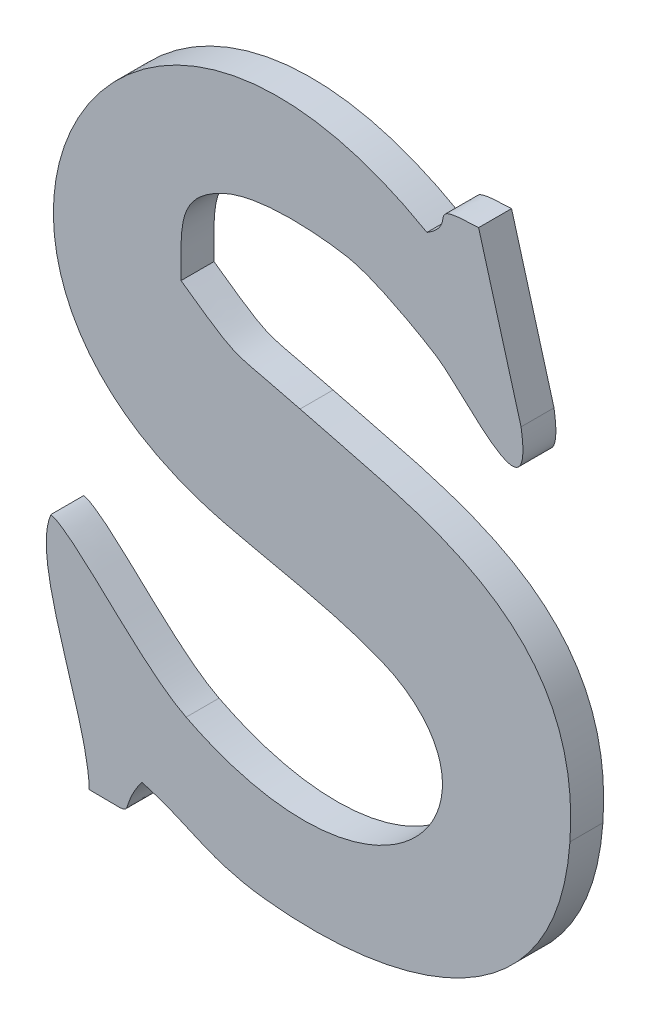
ISO-10303-21;
HEADER;
FILE_DESCRIPTION(('STEP AP214'),'2;1');
FILE_NAME('part.step','',(''),(''),'','','');
FILE_SCHEMA(('AUTOMOTIVE_DESIGN { 1 0 10303 214 1 1 1 1 }'));
ENDSEC;
DATA;
#1=APPLICATION_CONTEXT('core data for automotive mechanical design processes');
#2=APPLICATION_PROTOCOL_DEFINITION('international standard','automotive_design',2000,#1);
#3=PRODUCT_CONTEXT('',#1,'mechanical');
#4=PRODUCT('Part','Part','',(#3));
#5=PRODUCT_RELATED_PRODUCT_CATEGORY('part','',(#4));
#6=PRODUCT_DEFINITION_FORMATION('','',#4);
#7=PRODUCT_DEFINITION_CONTEXT('part definition',#1,'design');
#8=PRODUCT_DEFINITION('design','',#6,#7);
#9=PRODUCT_DEFINITION_SHAPE('','',#8);
#10=(LENGTH_UNIT() NAMED_UNIT(*) SI_UNIT(.MILLI.,.METRE.));
#11=(NAMED_UNIT(*) PLANE_ANGLE_UNIT() SI_UNIT($,.RADIAN.));
#12=(NAMED_UNIT(*) SI_UNIT($,.STERADIAN.) SOLID_ANGLE_UNIT());
#13=UNCERTAINTY_MEASURE_WITH_UNIT(LENGTH_MEASURE(1.E-05),#10,'distance_accuracy_value','');
#14=(GEOMETRIC_REPRESENTATION_CONTEXT(3) GLOBAL_UNCERTAINTY_ASSIGNED_CONTEXT((#13)) GLOBAL_UNIT_ASSIGNED_CONTEXT((#10,
#11,#12)) REPRESENTATION_CONTEXT('',''));
#15=CARTESIAN_POINT('',(0.,0.,0.));
#16=DIRECTION('',(0.,0.,1.));
#17=DIRECTION('',(1.,0.,0.));
#18=AXIS2_PLACEMENT_3D('',#15,#16,#17);
#19=CARTESIAN_POINT('',(50.3180959999998,11.206695,0.001));
#20=CARTESIAN_POINT('',(50.3180959999998,11.206695,0.));
#21=CARTESIAN_POINT('',(50.3213579999998,11.204469,0.001));
#22=CARTESIAN_POINT('',(50.3213579999998,11.204469,0.));
#23=CARTESIAN_POINT('',(50.3172699999998,11.199681,0.001));
#24=CARTESIAN_POINT('',(50.3172699999998,11.199681,0.));
#25=CARTESIAN_POINT('',(50.3114739999998,11.202621,0.001));
#26=CARTESIAN_POINT('',(50.3114739999998,11.202621,0.));
#27=B_SPLINE_SURFACE_WITH_KNOTS('',3,1,((#19,#20),(#21,#22),(#23,#24),(#25,#26)),.UNSPECIFIED.,
.F.,.F.,.F.,(4,4),(2,2),(0.823529411764706,0.882352941176471),(0.,1.),.UNSPECIFIED.);
#28=CARTESIAN_POINT('',(50.3180959999998,11.206695,0.));
#29=CARTESIAN_POINT('',(50.3213579999998,11.204469,0.));
#30=CARTESIAN_POINT('',(50.3172699999998,11.199681,0.));
#31=CARTESIAN_POINT('',(50.3114739999998,11.202621,0.));
#32=B_SPLINE_CURVE_WITH_KNOTS('',3,(#28,#29,#30,#31),.UNSPECIFIED.,.F.,.F.,(4,4),
(0.823529411764706,0.882352941176471),.UNSPECIFIED.);
#33=CARTESIAN_POINT('',(50.3180959999998,11.206695,0.));
#34=VERTEX_POINT('',#33);
#35=CARTESIAN_POINT('',(50.3114739999998,11.202621,0.));
#36=VERTEX_POINT('',#35);
#37=EDGE_CURVE('E11',#34,#36,#32,.T.);
#38=DIRECTION('',(0.,0.,-1.));
#39=VECTOR('',#38,1.);
#40=CARTESIAN_POINT('',(50.3114739999998,11.202621,0.001));
#41=LINE('',#40,#39);
#42=CARTESIAN_POINT('',(50.3114739999998,11.202621,0.001));
#43=VERTEX_POINT('',#42);
#44=EDGE_CURVE('E28',#43,#36,#41,.T.);
#45=CARTESIAN_POINT('',(50.3180959999998,11.206695,0.001));
#46=CARTESIAN_POINT('',(50.3213579999998,11.204469,0.001));
#47=CARTESIAN_POINT('',(50.3172699999998,11.199681,0.001));
#48=CARTESIAN_POINT('',(50.3114739999998,11.202621,0.001));
#49=B_SPLINE_CURVE_WITH_KNOTS('',3,(#45,#46,#47,#48),.UNSPECIFIED.,.F.,.F.,(4,4),
(0.823529411764706,0.882352941176471),.UNSPECIFIED.);
#50=CARTESIAN_POINT('',(50.3180959999998,11.206695,0.001));
#51=VERTEX_POINT('',#50);
#52=EDGE_CURVE('E389',#51,#43,#49,.T.);
#53=DIRECTION('',(0.,0.,-1.));
#54=VECTOR('',#53,1.);
#55=CARTESIAN_POINT('',(50.3180959999998,11.206695,0.001));
#56=LINE('',#55,#54);
#57=EDGE_CURVE('E40',#51,#34,#56,.T.);
#58=ORIENTED_EDGE('',*,*,#37,.T.);
#59=ORIENTED_EDGE('',*,*,#44,.F.);
#60=ORIENTED_EDGE('',*,*,#52,.F.);
#61=ORIENTED_EDGE('',*,*,#57,.T.);
#62=EDGE_LOOP('',(#58,#59,#60,#61));
#63=FACE_BOUND('',#62,.T.);
#64=ADVANCED_FACE('F17',(#63),#27,.F.);
#65=CARTESIAN_POINT('',(50.3114739999998,11.202621,0.001));
#66=CARTESIAN_POINT('',(50.3114739999998,11.202621,0.));
#67=CARTESIAN_POINT('',(50.3100599999998,11.203335,0.001));
#68=CARTESIAN_POINT('',(50.3100599999998,11.203335,0.));
#69=CARTESIAN_POINT('',(50.3081559999998,11.205673,0.001));
#70=CARTESIAN_POINT('',(50.3081559999998,11.205673,0.));
#71=CARTESIAN_POINT('',(50.3073719999998,11.205897,0.001));
#72=CARTESIAN_POINT('',(50.3073719999998,11.205897,0.));
#73=B_SPLINE_SURFACE_WITH_KNOTS('',3,1,((#65,#66),(#67,#68),(#69,#70),(#71,#72)),.UNSPECIFIED.,
.F.,.F.,.F.,(4,4),(2,2),(0.882352941176471,1.),(0.,1.),.UNSPECIFIED.);
#74=CARTESIAN_POINT('',(50.3114739999998,11.202621,0.));
#75=CARTESIAN_POINT('',(50.3100599999998,11.203335,0.));
#76=CARTESIAN_POINT('',(50.3081559999998,11.205673,0.));
#77=CARTESIAN_POINT('',(50.3073719999998,11.205897,0.));
#78=B_SPLINE_CURVE_WITH_KNOTS('',3,(#74,#75,#76,#77),.UNSPECIFIED.,.F.,.F.,(4,4),
(0.882352941176471,1.),.UNSPECIFIED.);
#79=CARTESIAN_POINT('',(50.3073719999998,11.205897,0.));
#80=VERTEX_POINT('',#79);
#81=EDGE_CURVE('E381',#36,#80,#78,.T.);
#82=DIRECTION('',(0.,0.,-1.));
#83=VECTOR('',#82,1.);
#84=CARTESIAN_POINT('',(50.3073719999998,11.205897,0.001));
#85=LINE('',#84,#83);
#86=CARTESIAN_POINT('',(50.3073719999998,11.205897,0.001));
#87=VERTEX_POINT('',#86);
#88=EDGE_CURVE('E376',#87,#80,#85,.T.);
#89=CARTESIAN_POINT('',(50.3114739999998,11.202621,0.001));
#90=CARTESIAN_POINT('',(50.3100599999998,11.203335,0.001));
#91=CARTESIAN_POINT('',(50.3081559999998,11.205673,0.001));
#92=CARTESIAN_POINT('',(50.3073719999998,11.205897,0.001));
#93=B_SPLINE_CURVE_WITH_KNOTS('',3,(#89,#90,#91,#92),.UNSPECIFIED.,.F.,.F.,(4,4),
(0.882352941176471,1.),.UNSPECIFIED.);
#94=EDGE_CURVE('E369',#43,#87,#93,.T.);
#95=ORIENTED_EDGE('',*,*,#81,.T.);
#96=ORIENTED_EDGE('',*,*,#88,.F.);
#97=ORIENTED_EDGE('',*,*,#94,.F.);
#98=ORIENTED_EDGE('',*,*,#44,.T.);
#99=EDGE_LOOP('',(#95,#96,#97,#98));
#100=FACE_BOUND('',#99,.T.);
#101=ADVANCED_FACE('F397',(#100),#73,.F.);
#102=CARTESIAN_POINT('',(50.3073719999998,11.205897,0.001));
#103=CARTESIAN_POINT('',(50.3073719999998,11.205897,0.));
#104=CARTESIAN_POINT('',(50.3067279999998,11.204385,0.001));
#105=CARTESIAN_POINT('',(50.3067279999998,11.204385,0.));
#106=CARTESIAN_POINT('',(50.3085059999998,11.201095,0.001));
#107=CARTESIAN_POINT('',(50.3085059999998,11.201095,0.));
#108=CARTESIAN_POINT('',(50.3085339999998,11.199247,0.001));
#109=CARTESIAN_POINT('',(50.3085339999998,11.199247,0.));
#110=B_SPLINE_SURFACE_WITH_KNOTS('',3,1,((#102,#103),(#104,#105),(#106,#107),(#108,#109)),
.UNSPECIFIED.,.F.,.F.,.F.,(4,4),(2,2),(0.,0.0588235294117647),(0.,1.),.UNSPECIFIED.);
#111=CARTESIAN_POINT('',(50.3073719999998,11.205897,0.));
#112=CARTESIAN_POINT('',(50.3067279999998,11.204385,0.));
#113=CARTESIAN_POINT('',(50.3085059999998,11.201095,0.));
#114=CARTESIAN_POINT('',(50.3085339999998,11.199247,0.));
#115=B_SPLINE_CURVE_WITH_KNOTS('',3,(#111,#112,#113,#114),.UNSPECIFIED.,.F.,.F.,(4,4),(0.,
0.0588235294117647),.UNSPECIFIED.);
#116=CARTESIAN_POINT('',(50.3085339999998,11.199247,0.));
#117=VERTEX_POINT('',#116);
#118=EDGE_CURVE('E364',#80,#117,#115,.T.);
#119=DIRECTION('',(0.,0.,-1.));
#120=VECTOR('',#119,1.);
#121=CARTESIAN_POINT('',(50.3085339999998,11.199247,0.001));
#122=LINE('',#121,#120);
#123=CARTESIAN_POINT('',(50.3085339999998,11.199247,0.001));
#124=VERTEX_POINT('',#123);
#125=EDGE_CURVE('E359',#124,#117,#122,.T.);
#126=CARTESIAN_POINT('',(50.3073719999998,11.205897,0.001));
#127=CARTESIAN_POINT('',(50.3067279999998,11.204385,0.001));
#128=CARTESIAN_POINT('',(50.3085059999998,11.201095,0.001));
#129=CARTESIAN_POINT('',(50.3085339999998,11.199247,0.001));
#130=B_SPLINE_CURVE_WITH_KNOTS('',3,(#126,#127,#128,#129),.UNSPECIFIED.,.F.,.F.,(4,4),(0.,
0.0588235294117647),.UNSPECIFIED.);
#131=EDGE_CURVE('E352',#87,#124,#130,.T.);
#132=ORIENTED_EDGE('',*,*,#118,.T.);
#133=ORIENTED_EDGE('',*,*,#125,.F.);
#134=ORIENTED_EDGE('',*,*,#131,.F.);
#135=ORIENTED_EDGE('',*,*,#88,.T.);
#136=EDGE_LOOP('',(#132,#133,#134,#135));
#137=FACE_BOUND('',#136,.T.);
#138=ADVANCED_FACE('F402',(#137),#110,.F.);
#139=CARTESIAN_POINT('',(50.3085339999998,11.199247,0.000999999999999998));
#140=CARTESIAN_POINT('',(50.3085339999998,11.199247,0.));
#141=CARTESIAN_POINT('',(50.3102279999998,11.199247,0.000999999999999998));
#142=CARTESIAN_POINT('',(50.3102279999998,11.199247,0.));
#143=CARTESIAN_POINT('',(50.3092759999998,11.199065,0.000999999999999998));
#144=CARTESIAN_POINT('',(50.3092759999998,11.199065,0.));
#145=CARTESIAN_POINT('',(50.3101299999998,11.200241,0.000999999999999998));
#146=CARTESIAN_POINT('',(50.3101299999998,11.200241,0.));
#147=B_SPLINE_SURFACE_WITH_KNOTS('',3,1,((#139,#140),(#141,#142),(#143,#144),(#145,#146)),
.UNSPECIFIED.,.F.,.F.,.F.,(4,4),(2,2),(0.0588235294117647,0.117647058823529),(0.,1.),.UNSPECIFIED.);
#148=CARTESIAN_POINT('',(50.3085339999998,11.199247,0.));
#149=CARTESIAN_POINT('',(50.3102279999998,11.199247,0.));
#150=CARTESIAN_POINT('',(50.3092759999998,11.199065,0.));
#151=CARTESIAN_POINT('',(50.3101299999998,11.200241,0.));
#152=B_SPLINE_CURVE_WITH_KNOTS('',3,(#148,#149,#150,#151),.UNSPECIFIED.,.F.,.F.,(4,4),
(0.0588235294117647,0.117647058823529),.UNSPECIFIED.);
#153=CARTESIAN_POINT('',(50.3101299999998,11.200241,0.));
#154=VERTEX_POINT('',#153);
#155=EDGE_CURVE('E347',#117,#154,#152,.T.);
#156=DIRECTION('',(0.,0.,-1.));
#157=VECTOR('',#156,1.);
#158=CARTESIAN_POINT('',(50.3101299999998,11.200241,0.000999999999999998));
#159=LINE('',#158,#157);
#160=CARTESIAN_POINT('',(50.3101299999998,11.200241,0.000999999999999998));
#161=VERTEX_POINT('',#160);
#162=EDGE_CURVE('E342',#161,#154,#159,.T.);
#163=CARTESIAN_POINT('',(50.3085339999998,11.199247,0.001));
#164=CARTESIAN_POINT('',(50.3102279999998,11.199247,0.000999999999999998));
#165=CARTESIAN_POINT('',(50.3092759999998,11.199065,0.000999999999999998));
#166=CARTESIAN_POINT('',(50.3101299999998,11.200241,0.000999999999999998));
#167=B_SPLINE_CURVE_WITH_KNOTS('',3,(#163,#164,#165,#166),.UNSPECIFIED.,.F.,.F.,(4,4),
(0.0588235294117647,0.117647058823529),.UNSPECIFIED.);
#168=EDGE_CURVE('E335',#124,#161,#167,.T.);
#169=ORIENTED_EDGE('',*,*,#155,.T.);
#170=ORIENTED_EDGE('',*,*,#162,.F.);
#171=ORIENTED_EDGE('',*,*,#168,.F.);
#172=ORIENTED_EDGE('',*,*,#125,.T.);
#173=EDGE_LOOP('',(#169,#170,#171,#172));
#174=FACE_BOUND('',#173,.T.);
#175=ADVANCED_FACE('F408',(#174),#147,.F.);
#176=CARTESIAN_POINT('',(50.3101299999998,11.200241,0.001));
#177=CARTESIAN_POINT('',(50.3101299999998,11.200241,0.));
#178=CARTESIAN_POINT('',(50.3115299999998,11.199877,0.001));
#179=CARTESIAN_POINT('',(50.3115299999998,11.199877,0.));
#180=CARTESIAN_POINT('',(50.3121039999998,11.199233,0.001));
#181=CARTESIAN_POINT('',(50.3121039999998,11.199233,0.));
#182=CARTESIAN_POINT('',(50.3138959999998,11.199037,0.001));
#183=CARTESIAN_POINT('',(50.3138959999998,11.199037,0.));
#184=B_SPLINE_SURFACE_WITH_KNOTS('',3,1,((#176,#177),(#178,#179),(#180,#181),(#182,#183)),
.UNSPECIFIED.,.F.,.F.,.F.,(4,4),(2,2),(0.117647058823529,0.176470588235294),(0.,1.),.UNSPECIFIED.);
#185=CARTESIAN_POINT('',(50.3101299999998,11.200241,0.));
#186=CARTESIAN_POINT('',(50.3115299999998,11.199877,0.));
#187=CARTESIAN_POINT('',(50.3121039999998,11.199233,0.));
#188=CARTESIAN_POINT('',(50.3138959999998,11.199037,0.));
#189=B_SPLINE_CURVE_WITH_KNOTS('',3,(#185,#186,#187,#188),.UNSPECIFIED.,.F.,.F.,(4,4),
(0.117647058823529,0.176470588235294),.UNSPECIFIED.);
#190=CARTESIAN_POINT('',(50.3138959999998,11.199037,0.));
#191=VERTEX_POINT('',#190);
#192=EDGE_CURVE('E330',#154,#191,#189,.T.);
#193=DIRECTION('',(0.,0.,-1.));
#194=VECTOR('',#193,1.);
#195=CARTESIAN_POINT('',(50.3138959999998,11.199037,0.001));
#196=LINE('',#195,#194);
#197=CARTESIAN_POINT('',(50.3138959999998,11.199037,0.001));
#198=VERTEX_POINT('',#197);
#199=EDGE_CURVE('E325',#198,#191,#196,.T.);
#200=CARTESIAN_POINT('',(50.3101299999998,11.200241,0.000999999999999998));
#201=CARTESIAN_POINT('',(50.3115299999998,11.199877,0.001));
#202=CARTESIAN_POINT('',(50.3121039999998,11.199233,0.001));
#203=CARTESIAN_POINT('',(50.3138959999998,11.199037,0.001));
#204=B_SPLINE_CURVE_WITH_KNOTS('',3,(#200,#201,#202,#203),.UNSPECIFIED.,.F.,.F.,(4,4),
(0.117647058823529,0.176470588235294),.UNSPECIFIED.);
#205=EDGE_CURVE('E318',#161,#198,#204,.T.);
#206=ORIENTED_EDGE('',*,*,#192,.T.);
#207=ORIENTED_EDGE('',*,*,#199,.F.);
#208=ORIENTED_EDGE('',*,*,#205,.F.);
#209=ORIENTED_EDGE('',*,*,#162,.T.);
#210=EDGE_LOOP('',(#206,#207,#208,#209));
#211=FACE_BOUND('',#210,.T.);
#212=ADVANCED_FACE('F412',(#211),#184,.F.);
#213=CARTESIAN_POINT('',(50.3138959999998,11.199037,0.001));
#214=CARTESIAN_POINT('',(50.3138959999998,11.199037,0.));
#215=CARTESIAN_POINT('',(50.3180539999998,11.198575,0.001));
#216=CARTESIAN_POINT('',(50.3180539999998,11.198575,0.));
#217=CARTESIAN_POINT('',(50.3227579999998,11.200017,0.001));
#218=CARTESIAN_POINT('',(50.3227579999998,11.200017,0.));
#219=CARTESIAN_POINT('',(50.3231219999998,11.205169,0.001));
#220=CARTESIAN_POINT('',(50.3231219999998,11.205169,0.));
#221=B_SPLINE_SURFACE_WITH_KNOTS('',3,1,((#213,#214),(#215,#216),(#217,#218),(#219,#220)),
.UNSPECIFIED.,.F.,.F.,.F.,(4,4),(2,2),(0.176470588235294,0.235294117647059),(0.,1.),.UNSPECIFIED.);
#222=CARTESIAN_POINT('',(50.3138959999998,11.199037,0.));
#223=CARTESIAN_POINT('',(50.3180539999998,11.198575,0.));
#224=CARTESIAN_POINT('',(50.3227579999998,11.200017,0.));
#225=CARTESIAN_POINT('',(50.3231219999998,11.205169,0.));
#226=B_SPLINE_CURVE_WITH_KNOTS('',3,(#222,#223,#224,#225),.UNSPECIFIED.,.F.,.F.,(4,4),
(0.176470588235294,0.235294117647059),.UNSPECIFIED.);
#227=CARTESIAN_POINT('',(50.3231219999998,11.205169,0.));
#228=VERTEX_POINT('',#227);
#229=EDGE_CURVE('E313',#191,#228,#226,.T.);
#230=DIRECTION('',(0.,0.,-1.));
#231=VECTOR('',#230,1.);
#232=CARTESIAN_POINT('',(50.3231219999998,11.205169,0.001));
#233=LINE('',#232,#231);
#234=CARTESIAN_POINT('',(50.3231219999998,11.205169,0.001));
#235=VERTEX_POINT('',#234);
#236=EDGE_CURVE('E308',#235,#228,#233,.T.);
#237=CARTESIAN_POINT('',(50.3138959999998,11.199037,0.001));
#238=CARTESIAN_POINT('',(50.3180539999998,11.198575,0.001));
#239=CARTESIAN_POINT('',(50.3227579999998,11.200017,0.001));
#240=CARTESIAN_POINT('',(50.3231219999998,11.205169,0.001));
#241=B_SPLINE_CURVE_WITH_KNOTS('',3,(#237,#238,#239,#240),.UNSPECIFIED.,.F.,.F.,(4,4),
(0.176470588235294,0.235294117647059),.UNSPECIFIED.);
#242=EDGE_CURVE('E301',#198,#235,#241,.T.);
#243=ORIENTED_EDGE('',*,*,#229,.T.);
#244=ORIENTED_EDGE('',*,*,#236,.F.);
#245=ORIENTED_EDGE('',*,*,#242,.F.);
#246=ORIENTED_EDGE('',*,*,#199,.T.);
#247=EDGE_LOOP('',(#243,#244,#245,#246));
#248=FACE_BOUND('',#247,.T.);
#249=ADVANCED_FACE('F417',(#248),#221,.F.);
#250=CARTESIAN_POINT('',(50.3231219999998,11.205169,0.001));
#251=CARTESIAN_POINT('',(50.3231219999998,11.205169,0.));
#252=CARTESIAN_POINT('',(50.3235419999998,11.210937,0.001));
#253=CARTESIAN_POINT('',(50.3235419999998,11.210937,0.));
#254=CARTESIAN_POINT('',(50.3182779999998,11.211539,0.001));
#255=CARTESIAN_POINT('',(50.3182779999998,11.211539,0.));
#256=CARTESIAN_POINT('',(50.3149319999998,11.212449,0.001));
#257=CARTESIAN_POINT('',(50.3149319999998,11.212449,0.));
#258=B_SPLINE_SURFACE_WITH_KNOTS('',3,1,((#250,#251),(#252,#253),(#254,#255),(#256,#257)),
.UNSPECIFIED.,.F.,.F.,.F.,(4,4),(2,2),(0.235294117647059,0.294117647058823),(0.,1.),.UNSPECIFIED.);
#259=CARTESIAN_POINT('',(50.3231219999998,11.205169,0.));
#260=CARTESIAN_POINT('',(50.3235419999998,11.210937,0.));
#261=CARTESIAN_POINT('',(50.3182779999998,11.211539,0.));
#262=CARTESIAN_POINT('',(50.3149319999998,11.212449,0.));
#263=B_SPLINE_CURVE_WITH_KNOTS('',3,(#259,#260,#261,#262),.UNSPECIFIED.,.F.,.F.,(4,4),
(0.235294117647059,0.294117647058823),.UNSPECIFIED.);
#264=CARTESIAN_POINT('',(50.3149319999998,11.212449,0.));
#265=VERTEX_POINT('',#264);
#266=EDGE_CURVE('E296',#228,#265,#263,.T.);
#267=DIRECTION('',(0.,0.,-1.));
#268=VECTOR('',#267,1.);
#269=CARTESIAN_POINT('',(50.3149319999998,11.212449,0.001));
#270=LINE('',#269,#268);
#271=CARTESIAN_POINT('',(50.3149319999998,11.212449,0.001));
#272=VERTEX_POINT('',#271);
#273=EDGE_CURVE('E291',#272,#265,#270,.T.);
#274=CARTESIAN_POINT('',(50.3231219999998,11.205169,0.001));
#275=CARTESIAN_POINT('',(50.3235419999998,11.210937,0.001));
#276=CARTESIAN_POINT('',(50.3182779999998,11.211539,0.001));
#277=CARTESIAN_POINT('',(50.3149319999998,11.212449,0.001));
#278=B_SPLINE_CURVE_WITH_KNOTS('',3,(#274,#275,#276,#277),.UNSPECIFIED.,.F.,.F.,(4,4),
(0.235294117647059,0.294117647058823),.UNSPECIFIED.);
#279=EDGE_CURVE('E284',#235,#272,#278,.T.);
#280=ORIENTED_EDGE('',*,*,#266,.T.);
#281=ORIENTED_EDGE('',*,*,#273,.F.);
#282=ORIENTED_EDGE('',*,*,#279,.F.);
#283=ORIENTED_EDGE('',*,*,#236,.T.);
#284=EDGE_LOOP('',(#280,#281,#282,#283));
#285=FACE_BOUND('',#284,.T.);
#286=ADVANCED_FACE('F423',(#285),#258,.F.);
#287=CARTESIAN_POINT('',(50.3149319999998,11.212449,0.001));
#288=CARTESIAN_POINT('',(50.3149319999998,11.212449,0.));
#289=CARTESIAN_POINT('',(50.3127199999998,11.213037,0.001));
#290=CARTESIAN_POINT('',(50.3127199999998,11.213037,0.));
#291=CARTESIAN_POINT('',(50.3132379999998,11.212659,0.001));
#292=CARTESIAN_POINT('',(50.3132379999998,11.212659,0.));
#293=CARTESIAN_POINT('',(50.3113199999998,11.214017,0.001));
#294=CARTESIAN_POINT('',(50.3113199999998,11.214017,0.));
#295=B_SPLINE_SURFACE_WITH_KNOTS('',3,1,((#287,#288),(#289,#290),(#291,#292),(#293,#294)),
.UNSPECIFIED.,.F.,.F.,.F.,(4,4),(2,2),(0.294117647058823,0.352941176470588),(0.,1.),.UNSPECIFIED.);
#296=CARTESIAN_POINT('',(50.3149319999998,11.212449,0.));
#297=CARTESIAN_POINT('',(50.3127199999998,11.213037,0.));
#298=CARTESIAN_POINT('',(50.3132379999998,11.212659,0.));
#299=CARTESIAN_POINT('',(50.3113199999998,11.214017,0.));
#300=B_SPLINE_CURVE_WITH_KNOTS('',3,(#296,#297,#298,#299),.UNSPECIFIED.,.F.,.F.,(4,4),
(0.294117647058823,0.352941176470588),.UNSPECIFIED.);
#301=CARTESIAN_POINT('',(50.3113199999998,11.214017,0.));
#302=VERTEX_POINT('',#301);
#303=EDGE_CURVE('E279',#265,#302,#300,.T.);
#304=DIRECTION('',(0.,0.,-1.));
#305=VECTOR('',#304,1.);
#306=CARTESIAN_POINT('',(50.3113199999998,11.214017,0.001));
#307=LINE('',#306,#305);
#308=CARTESIAN_POINT('',(50.3113199999998,11.214017,0.001));
#309=VERTEX_POINT('',#308);
#310=EDGE_CURVE('E274',#309,#302,#307,.T.);
#311=CARTESIAN_POINT('',(50.3149319999998,11.212449,0.001));
#312=CARTESIAN_POINT('',(50.3127199999998,11.213037,0.001));
#313=CARTESIAN_POINT('',(50.3132379999998,11.212659,0.001));
#314=CARTESIAN_POINT('',(50.3113199999998,11.214017,0.001));
#315=B_SPLINE_CURVE_WITH_KNOTS('',3,(#311,#312,#313,#314),.UNSPECIFIED.,.F.,.F.,(4,4),
(0.294117647058823,0.352941176470588),.UNSPECIFIED.);
#316=EDGE_CURVE('E267',#272,#309,#315,.T.);
#317=ORIENTED_EDGE('',*,*,#303,.T.);
#318=ORIENTED_EDGE('',*,*,#310,.F.);
#319=ORIENTED_EDGE('',*,*,#316,.F.);
#320=ORIENTED_EDGE('',*,*,#273,.T.);
#321=EDGE_LOOP('',(#317,#318,#319,#320));
#322=FACE_BOUND('',#321,.T.);
#323=ADVANCED_FACE('F427',(#322),#295,.F.);
#324=CARTESIAN_POINT('',(50.3113199999998,11.214017,0.001));
#325=CARTESIAN_POINT('',(50.3113199999998,11.214017,0.));
#326=CARTESIAN_POINT('',(50.3113199999998,11.215431,0.001));
#327=CARTESIAN_POINT('',(50.3113199999998,11.215431,0.));
#328=CARTESIAN_POINT('',(50.3111799999998,11.216243,0.001));
#329=CARTESIAN_POINT('',(50.3111799999998,11.216243,0.));
#330=CARTESIAN_POINT('',(50.3125239999998,11.216915,0.001));
#331=CARTESIAN_POINT('',(50.3125239999998,11.216915,0.));
#332=B_SPLINE_SURFACE_WITH_KNOTS('',3,1,((#324,#325),(#326,#327),(#328,#329),(#330,#331)),
.UNSPECIFIED.,.F.,.F.,.F.,(4,4),(2,2),(0.352941176470588,0.411764705882353),(0.,1.),.UNSPECIFIED.);
#333=CARTESIAN_POINT('',(50.3113199999998,11.214017,0.));
#334=CARTESIAN_POINT('',(50.3113199999998,11.215431,0.));
#335=CARTESIAN_POINT('',(50.3111799999998,11.216243,0.));
#336=CARTESIAN_POINT('',(50.3125239999998,11.216915,0.));
#337=B_SPLINE_CURVE_WITH_KNOTS('',3,(#333,#334,#335,#336),.UNSPECIFIED.,.F.,.F.,(4,4),
(0.352941176470588,0.411764705882353),.UNSPECIFIED.);
#338=CARTESIAN_POINT('',(50.3125239999998,11.216915,0.));
#339=VERTEX_POINT('',#338);
#340=EDGE_CURVE('E262',#302,#339,#337,.T.);
#341=DIRECTION('',(0.,0.,-1.));
#342=VECTOR('',#341,1.);
#343=CARTESIAN_POINT('',(50.3125239999998,11.216915,0.001));
#344=LINE('',#343,#342);
#345=CARTESIAN_POINT('',(50.3125239999998,11.216915,0.001));
#346=VERTEX_POINT('',#345);
#347=EDGE_CURVE('E257',#346,#339,#344,.T.);
#348=CARTESIAN_POINT('',(50.3113199999998,11.214017,0.001));
#349=CARTESIAN_POINT('',(50.3113199999998,11.215431,0.001));
#350=CARTESIAN_POINT('',(50.3111799999998,11.216243,0.001));
#351=CARTESIAN_POINT('',(50.3125239999998,11.216915,0.001));
#352=B_SPLINE_CURVE_WITH_KNOTS('',3,(#348,#349,#350,#351),.UNSPECIFIED.,.F.,.F.,(4,4),
(0.352941176470588,0.411764705882353),.UNSPECIFIED.);
#353=EDGE_CURVE('E250',#309,#346,#352,.T.);
#354=ORIENTED_EDGE('',*,*,#340,.T.);
#355=ORIENTED_EDGE('',*,*,#347,.F.);
#356=ORIENTED_EDGE('',*,*,#353,.F.);
#357=ORIENTED_EDGE('',*,*,#310,.T.);
#358=EDGE_LOOP('',(#354,#355,#356,#357));
#359=FACE_BOUND('',#358,.T.);
#360=ADVANCED_FACE('F432',(#359),#332,.F.);
#361=CARTESIAN_POINT('',(50.3125239999998,11.216915,0.000999999999999998));
#362=CARTESIAN_POINT('',(50.3125239999998,11.216915,0.));
#363=CARTESIAN_POINT('',(50.3135459999998,11.217433,0.000999999999999998));
#364=CARTESIAN_POINT('',(50.3135459999998,11.217433,0.));
#365=CARTESIAN_POINT('',(50.3152259999998,11.217363,0.000999999999999998));
#366=CARTESIAN_POINT('',(50.3152259999998,11.217363,0.));
#367=CARTESIAN_POINT('',(50.3163599999998,11.217167,0.000999999999999998));
#368=CARTESIAN_POINT('',(50.3163599999998,11.217167,0.));
#369=B_SPLINE_SURFACE_WITH_KNOTS('',3,1,((#361,#362),(#363,#364),(#365,#366),(#367,#368)),
.UNSPECIFIED.,.F.,.F.,.F.,(4,4),(2,2),(0.411764705882353,0.470588235294118),(0.,1.),.UNSPECIFIED.);
#370=CARTESIAN_POINT('',(50.3125239999998,11.216915,0.));
#371=CARTESIAN_POINT('',(50.3135459999998,11.217433,0.));
#372=CARTESIAN_POINT('',(50.3152259999998,11.217363,0.));
#373=CARTESIAN_POINT('',(50.3163599999998,11.217167,0.));
#374=B_SPLINE_CURVE_WITH_KNOTS('',3,(#370,#371,#372,#373),.UNSPECIFIED.,.F.,.F.,(4,4),
(0.411764705882353,0.470588235294118),.UNSPECIFIED.);
#375=CARTESIAN_POINT('',(50.3163599999998,11.217167,0.));
#376=VERTEX_POINT('',#375);
#377=EDGE_CURVE('E245',#339,#376,#374,.T.);
#378=DIRECTION('',(0.,0.,-1.));
#379=VECTOR('',#378,1.);
#380=CARTESIAN_POINT('',(50.3163599999998,11.217167,0.000999999999999998));
#381=LINE('',#380,#379);
#382=CARTESIAN_POINT('',(50.3163599999998,11.217167,0.000999999999999998));
#383=VERTEX_POINT('',#382);
#384=EDGE_CURVE('E240',#383,#376,#381,.T.);
#385=CARTESIAN_POINT('',(50.3125239999998,11.216915,0.001));
#386=CARTESIAN_POINT('',(50.3135459999998,11.217433,0.000999999999999998));
#387=CARTESIAN_POINT('',(50.3152259999998,11.217363,0.000999999999999998));
#388=CARTESIAN_POINT('',(50.3163599999998,11.217167,0.000999999999999998));
#389=B_SPLINE_CURVE_WITH_KNOTS('',3,(#385,#386,#387,#388),.UNSPECIFIED.,.F.,.F.,(4,4),
(0.411764705882353,0.470588235294118),.UNSPECIFIED.);
#390=EDGE_CURVE('E233',#346,#383,#389,.T.);
#391=ORIENTED_EDGE('',*,*,#377,.T.);
#392=ORIENTED_EDGE('',*,*,#384,.F.);
#393=ORIENTED_EDGE('',*,*,#390,.F.);
#394=ORIENTED_EDGE('',*,*,#347,.T.);
#395=EDGE_LOOP('',(#391,#392,#393,#394));
#396=FACE_BOUND('',#395,.T.);
#397=ADVANCED_FACE('F438',(#396),#369,.F.);
#398=CARTESIAN_POINT('',(50.3163599999998,11.217167,0.001));
#399=CARTESIAN_POINT('',(50.3163599999998,11.217167,0.));
#400=CARTESIAN_POINT('',(50.3170879999998,11.217041,0.001));
#401=CARTESIAN_POINT('',(50.3170879999998,11.217041,0.));
#402=CARTESIAN_POINT('',(50.3183899999998,11.216341,0.001));
#403=CARTESIAN_POINT('',(50.3183899999998,11.216341,0.));
#404=CARTESIAN_POINT('',(50.3190899999998,11.215893,0.001));
#405=CARTESIAN_POINT('',(50.3190899999998,11.215893,0.));
#406=B_SPLINE_SURFACE_WITH_KNOTS('',3,1,((#398,#399),(#400,#401),(#402,#403),(#404,#405)),
.UNSPECIFIED.,.F.,.F.,.F.,(4,4),(2,2),(0.470588235294118,0.529411764705882),(0.,1.),.UNSPECIFIED.);
#407=CARTESIAN_POINT('',(50.3163599999998,11.217167,0.));
#408=CARTESIAN_POINT('',(50.3170879999998,11.217041,0.));
#409=CARTESIAN_POINT('',(50.3183899999998,11.216341,0.));
#410=CARTESIAN_POINT('',(50.3190899999998,11.215893,0.));
#411=B_SPLINE_CURVE_WITH_KNOTS('',3,(#407,#408,#409,#410),.UNSPECIFIED.,.F.,.F.,(4,4),
(0.470588235294118,0.529411764705882),.UNSPECIFIED.);
#412=CARTESIAN_POINT('',(50.3190899999998,11.215893,0.));
#413=VERTEX_POINT('',#412);
#414=EDGE_CURVE('E228',#376,#413,#411,.T.);
#415=DIRECTION('',(0.,0.,-1.));
#416=VECTOR('',#415,1.);
#417=CARTESIAN_POINT('',(50.3190899999998,11.215893,0.001));
#418=LINE('',#417,#416);
#419=CARTESIAN_POINT('',(50.3190899999998,11.215893,0.001));
#420=VERTEX_POINT('',#419);
#421=EDGE_CURVE('E223',#420,#413,#418,.T.);
#422=CARTESIAN_POINT('',(50.3163599999998,11.217167,0.000999999999999998));
#423=CARTESIAN_POINT('',(50.3170879999998,11.217041,0.001));
#424=CARTESIAN_POINT('',(50.3183899999998,11.216341,0.001));
#425=CARTESIAN_POINT('',(50.3190899999998,11.215893,0.001));
#426=B_SPLINE_CURVE_WITH_KNOTS('',3,(#422,#423,#424,#425),.UNSPECIFIED.,.F.,.F.,(4,4),
(0.470588235294118,0.529411764705882),.UNSPECIFIED.);
#427=EDGE_CURVE('E216',#383,#420,#426,.T.);
#428=ORIENTED_EDGE('',*,*,#414,.T.);
#429=ORIENTED_EDGE('',*,*,#421,.F.);
#430=ORIENTED_EDGE('',*,*,#427,.F.);
#431=ORIENTED_EDGE('',*,*,#384,.T.);
#432=EDGE_LOOP('',(#428,#429,#430,#431));
#433=FACE_BOUND('',#432,.T.);
#434=ADVANCED_FACE('F442',(#433),#406,.F.);
#435=CARTESIAN_POINT('',(50.3190899999998,11.215893,0.001));
#436=CARTESIAN_POINT('',(50.3190899999998,11.215893,0.));
#437=CARTESIAN_POINT('',(50.3198599999998,11.215403,0.001));
#438=CARTESIAN_POINT('',(50.3198599999998,11.215403,0.));
#439=CARTESIAN_POINT('',(50.3220719999998,11.212645,0.001));
#440=CARTESIAN_POINT('',(50.3220719999998,11.212645,0.));
#441=CARTESIAN_POINT('',(50.3216379999998,11.215333,0.001));
#442=CARTESIAN_POINT('',(50.3216379999998,11.215333,0.));
#443=B_SPLINE_SURFACE_WITH_KNOTS('',3,1,((#435,#436),(#437,#438),(#439,#440),(#441,#442)),
.UNSPECIFIED.,.F.,.F.,.F.,(4,4),(2,2),(0.529411764705882,0.588235294117647),(0.,1.),.UNSPECIFIED.);
#444=CARTESIAN_POINT('',(50.3190899999998,11.215893,0.));
#445=CARTESIAN_POINT('',(50.3198599999998,11.215403,0.));
#446=CARTESIAN_POINT('',(50.3220719999998,11.212645,0.));
#447=CARTESIAN_POINT('',(50.3216379999998,11.215333,0.));
#448=B_SPLINE_CURVE_WITH_KNOTS('',3,(#444,#445,#446,#447),.UNSPECIFIED.,.F.,.F.,(4,4),
(0.529411764705882,0.588235294117647),.UNSPECIFIED.);
#449=CARTESIAN_POINT('',(50.3216379999998,11.215333,0.));
#450=VERTEX_POINT('',#449);
#451=EDGE_CURVE('E211',#413,#450,#448,.T.);
#452=DIRECTION('',(0.,0.,-1.));
#453=VECTOR('',#452,1.);
#454=CARTESIAN_POINT('',(50.3216379999998,11.215333,0.001));
#455=LINE('',#454,#453);
#456=CARTESIAN_POINT('',(50.3216379999998,11.215333,0.001));
#457=VERTEX_POINT('',#456);
#458=EDGE_CURVE('E206',#457,#450,#455,.T.);
#459=CARTESIAN_POINT('',(50.3190899999998,11.215893,0.001));
#460=CARTESIAN_POINT('',(50.3198599999998,11.215403,0.001));
#461=CARTESIAN_POINT('',(50.3220719999998,11.212645,0.001));
#462=CARTESIAN_POINT('',(50.3216379999998,11.215333,0.001));
#463=B_SPLINE_CURVE_WITH_KNOTS('',3,(#459,#460,#461,#462),.UNSPECIFIED.,.F.,.F.,(4,4),
(0.529411764705882,0.588235294117647),.UNSPECIFIED.);
#464=EDGE_CURVE('E202',#420,#457,#463,.T.);
#465=ORIENTED_EDGE('',*,*,#451,.T.);
#466=ORIENTED_EDGE('',*,*,#458,.F.);
#467=ORIENTED_EDGE('',*,*,#464,.F.);
#468=ORIENTED_EDGE('',*,*,#421,.T.);
#469=EDGE_LOOP('',(#465,#466,#467,#468));
#470=FACE_BOUND('',#469,.T.);
#471=ADVANCED_FACE('F447',(#470),#443,.F.);
#472=CARTESIAN_POINT('',(49.5677391355242,13.9031463429096,0.001));
#473=DIRECTION('',(-0.962841971923705,-0.270065431149696,0.));
#474=DIRECTION('',(0.270065431149696,-0.962841971923705,0.));
#475=AXIS2_PLACEMENT_3D('',#472,#473,#474);
#476=PLANE('',#475);
#477=DIRECTION('',(-0.270065431149696,0.962841971923705,0.));
#478=VECTOR('',#477,1.);
#479=CARTESIAN_POINT('',(49.5677391355242,13.9031463429096,0.));
#480=LINE('',#479,#478);
#481=CARTESIAN_POINT('',(50.3203499999998,11.219925,0.));
#482=VERTEX_POINT('',#481);
#483=EDGE_CURVE('E200',#450,#482,#480,.T.);
#484=ORIENTED_EDGE('',*,*,#483,.T.);
#485=DIRECTION('',(0.,0.,-1.));
#486=VECTOR('',#485,1.);
#487=CARTESIAN_POINT('',(50.3203499999998,11.219925,0.001));
#488=LINE('',#487,#486);
#489=CARTESIAN_POINT('',(50.3203499999998,11.219925,0.001));
#490=VERTEX_POINT('',#489);
#491=EDGE_CURVE('E197',#490,#482,#488,.T.);
#492=ORIENTED_EDGE('',*,*,#491,.F.);
#493=DIRECTION('',(-0.270065431149696,0.962841971923705,0.));
#494=VECTOR('',#493,1.);
#495=CARTESIAN_POINT('',(49.5677391355242,13.9031463429096,0.001));
#496=LINE('',#495,#494);
#497=EDGE_CURVE('E192',#457,#490,#496,.T.);
#498=ORIENTED_EDGE('',*,*,#497,.F.);
#499=ORIENTED_EDGE('',*,*,#458,.T.);
#500=EDGE_LOOP('',(#484,#492,#498,#499));
#501=FACE_BOUND('',#500,.T.);
#502=ADVANCED_FACE('F456',(#501),#476,.F.);
#503=CARTESIAN_POINT('',(50.3203499999998,11.219925,0.001));
#504=CARTESIAN_POINT('',(50.3203499999998,11.219925,0.));
#505=CARTESIAN_POINT('',(50.3185859999998,11.219883,0.001));
#506=CARTESIAN_POINT('',(50.3185859999998,11.219883,0.));
#507=CARTESIAN_POINT('',(50.3197899999998,11.219631,0.001));
#508=CARTESIAN_POINT('',(50.3197899999998,11.219631,0.));
#509=CARTESIAN_POINT('',(50.3187819999998,11.219015,0.001));
#510=CARTESIAN_POINT('',(50.3187819999998,11.219015,0.));
#511=B_SPLINE_SURFACE_WITH_KNOTS('',3,1,((#503,#504),(#505,#506),(#507,#508),(#509,#510)),
.UNSPECIFIED.,.F.,.F.,.F.,(4,4),(2,2),(0.647058823529412,0.705882352941177),(0.,1.),.UNSPECIFIED.);
#512=CARTESIAN_POINT('',(50.3203499999998,11.219925,0.));
#513=CARTESIAN_POINT('',(50.3185859999998,11.219883,0.));
#514=CARTESIAN_POINT('',(50.3197899999998,11.219631,0.));
#515=CARTESIAN_POINT('',(50.3187819999998,11.219015,0.));
#516=B_SPLINE_CURVE_WITH_KNOTS('',3,(#512,#513,#514,#515),.UNSPECIFIED.,.F.,.F.,(4,4),
(0.647058823529412,0.705882352941177),.UNSPECIFIED.);
#517=CARTESIAN_POINT('',(50.3187819999998,11.219015,0.));
#518=VERTEX_POINT('',#517);
#519=EDGE_CURVE('E187',#482,#518,#516,.T.);
#520=DIRECTION('',(0.,0.,-1.));
#521=VECTOR('',#520,1.);
#522=CARTESIAN_POINT('',(50.3187819999998,11.219015,0.001));
#523=LINE('',#522,#521);
#524=CARTESIAN_POINT('',(50.3187819999998,11.219015,0.001));
#525=VERTEX_POINT('',#524);
#526=EDGE_CURVE('E182',#525,#518,#523,.T.);
#527=CARTESIAN_POINT('',(50.3203499999998,11.219925,0.001));
#528=CARTESIAN_POINT('',(50.3185859999998,11.219883,0.001));
#529=CARTESIAN_POINT('',(50.3197899999998,11.219631,0.001));
#530=CARTESIAN_POINT('',(50.3187819999998,11.219015,0.001));
#531=B_SPLINE_CURVE_WITH_KNOTS('',3,(#527,#528,#529,#530),.UNSPECIFIED.,.F.,.F.,(4,4),
(0.647058823529412,0.705882352941177),.UNSPECIFIED.);
#532=EDGE_CURVE('E140',#490,#525,#531,.T.);
#533=ORIENTED_EDGE('',*,*,#519,.T.);
#534=ORIENTED_EDGE('',*,*,#526,.F.);
#535=ORIENTED_EDGE('',*,*,#532,.F.);
#536=ORIENTED_EDGE('',*,*,#491,.T.);
#537=EDGE_LOOP('',(#533,#534,#535,#536));
#538=FACE_BOUND('',#537,.T.);
#539=ADVANCED_FACE('F451',(#538),#511,.F.);
#540=CARTESIAN_POINT('',(50.3187819999998,11.219015,0.000999999999999998));
#541=CARTESIAN_POINT('',(50.3187819999998,11.219015,0.));
#542=CARTESIAN_POINT('',(50.3091359999998,11.224559,0.000999999999999998));
#543=CARTESIAN_POINT('',(50.3091359999998,11.224559,0.));
#544=CARTESIAN_POINT('',(50.3022199999998,11.210909,0.000999999999999998));
#545=CARTESIAN_POINT('',(50.3022199999998,11.210909,0.));
#546=CARTESIAN_POINT('',(50.3126499999998,11.208305,0.000999999999999998));
#547=CARTESIAN_POINT('',(50.3126499999998,11.208305,0.));
#548=B_SPLINE_SURFACE_WITH_KNOTS('',3,1,((#540,#541),(#542,#543),(#544,#545),(#546,#547)),
.UNSPECIFIED.,.F.,.F.,.F.,(4,4),(2,2),(0.705882352941177,0.764705882352941),(0.,1.),.UNSPECIFIED.);
#549=CARTESIAN_POINT('',(50.3187819999998,11.219015,0.));
#550=CARTESIAN_POINT('',(50.3091359999998,11.224559,0.));
#551=CARTESIAN_POINT('',(50.3022199999998,11.210909,0.));
#552=CARTESIAN_POINT('',(50.3126499999998,11.208305,0.));
#553=B_SPLINE_CURVE_WITH_KNOTS('',3,(#549,#550,#551,#552),.UNSPECIFIED.,.F.,.F.,(4,4),
(0.705882352941177,0.764705882352941),.UNSPECIFIED.);
#554=CARTESIAN_POINT('',(50.3126499999998,11.208305,0.));
#555=VERTEX_POINT('',#554);
#556=EDGE_CURVE('E149',#518,#555,#553,.T.);
#557=DIRECTION('',(0.,0.,-1.));
#558=VECTOR('',#557,1.);
#559=CARTESIAN_POINT('',(50.3126499999998,11.208305,0.000999999999999998));
#560=LINE('',#559,#558);
#561=CARTESIAN_POINT('',(50.3126499999998,11.208305,0.000999999999999998));
#562=VERTEX_POINT('',#561);
#563=EDGE_CURVE('E143',#562,#555,#560,.T.);
#564=CARTESIAN_POINT('',(50.3187819999998,11.219015,0.001));
#565=CARTESIAN_POINT('',(50.3091359999998,11.224559,0.000999999999999998));
#566=CARTESIAN_POINT('',(50.3022199999998,11.210909,0.000999999999999998));
#567=CARTESIAN_POINT('',(50.3126499999998,11.208305,0.000999999999999998));
#568=B_SPLINE_CURVE_WITH_KNOTS('',3,(#564,#565,#566,#567),.UNSPECIFIED.,.F.,.F.,(4,4),
(0.705882352941177,0.764705882352941),.UNSPECIFIED.);
#569=EDGE_CURVE('E133',#525,#562,#568,.T.);
#570=ORIENTED_EDGE('',*,*,#556,.T.);
#571=ORIENTED_EDGE('',*,*,#563,.F.);
#572=ORIENTED_EDGE('',*,*,#569,.F.);
#573=ORIENTED_EDGE('',*,*,#526,.T.);
#574=EDGE_LOOP('',(#570,#571,#572,#573));
#575=FACE_BOUND('',#574,.T.);
#576=ADVANCED_FACE('F147',(#575),#548,.F.);
#577=CARTESIAN_POINT('',(50.3126499999998,11.208305,0.001));
#578=CARTESIAN_POINT('',(50.3126499999998,11.208305,0.));
#579=CARTESIAN_POINT('',(50.3140219999998,11.207955,0.001));
#580=CARTESIAN_POINT('',(50.3140219999998,11.207955,0.));
#581=CARTESIAN_POINT('',(50.3169339999998,11.207493,0.001));
#582=CARTESIAN_POINT('',(50.3169339999998,11.207493,0.));
#583=CARTESIAN_POINT('',(50.3180959999998,11.206695,0.001));
#584=CARTESIAN_POINT('',(50.3180959999998,11.206695,0.));
#585=B_SPLINE_SURFACE_WITH_KNOTS('',3,1,((#577,#578),(#579,#580),(#581,#582),(#583,#584)),
.UNSPECIFIED.,.F.,.F.,.F.,(4,4),(2,2),(0.764705882352941,0.823529411764706),(0.,1.),.UNSPECIFIED.);
#586=CARTESIAN_POINT('',(50.3126499999998,11.208305,0.));
#587=CARTESIAN_POINT('',(50.3140219999998,11.207955,0.));
#588=CARTESIAN_POINT('',(50.3169339999998,11.207493,0.));
#589=CARTESIAN_POINT('',(50.3180959999998,11.206695,0.));
#590=B_SPLINE_CURVE_WITH_KNOTS('',3,(#586,#587,#588,#589),.UNSPECIFIED.,.F.,.F.,(4,4),
(0.764705882352941,0.823529411764706),.UNSPECIFIED.);
#591=EDGE_CURVE('E144',#555,#34,#590,.T.);
#592=CARTESIAN_POINT('',(50.3126499999998,11.208305,0.000999999999999998));
#593=CARTESIAN_POINT('',(50.3140219999998,11.207955,0.001));
#594=CARTESIAN_POINT('',(50.3169339999998,11.207493,0.001));
#595=CARTESIAN_POINT('',(50.3180959999998,11.206695,0.001));
#596=B_SPLINE_CURVE_WITH_KNOTS('',3,(#592,#593,#594,#595),.UNSPECIFIED.,.F.,.F.,(4,4),
(0.764705882352941,0.823529411764706),.UNSPECIFIED.);
#597=EDGE_CURVE('E137',#562,#51,#596,.T.);
#598=ORIENTED_EDGE('',*,*,#591,.T.);
#599=ORIENTED_EDGE('',*,*,#57,.F.);
#600=ORIENTED_EDGE('',*,*,#597,.F.);
#601=ORIENTED_EDGE('',*,*,#563,.T.);
#602=EDGE_LOOP('',(#598,#599,#600,#601));
#603=FACE_BOUND('',#602,.T.);
#604=ADVANCED_FACE('F154',(#603),#585,.F.);
#605=CARTESIAN_POINT('',(0.,0.,0.001));
#606=DIRECTION('',(0.,0.,1.));
#607=DIRECTION('',(1.,0.,0.));
#608=AXIS2_PLACEMENT_3D('',#605,#606,#607);
#609=PLANE('',#608);
#610=ORIENTED_EDGE('',*,*,#52,.T.);
#611=ORIENTED_EDGE('',*,*,#94,.T.);
#612=ORIENTED_EDGE('',*,*,#131,.T.);
#613=ORIENTED_EDGE('',*,*,#168,.T.);
#614=ORIENTED_EDGE('',*,*,#205,.T.);
#615=ORIENTED_EDGE('',*,*,#242,.T.);
#616=ORIENTED_EDGE('',*,*,#279,.T.);
#617=ORIENTED_EDGE('',*,*,#316,.T.);
#618=ORIENTED_EDGE('',*,*,#353,.T.);
#619=ORIENTED_EDGE('',*,*,#390,.T.);
#620=ORIENTED_EDGE('',*,*,#427,.T.);
#621=ORIENTED_EDGE('',*,*,#464,.T.);
#622=ORIENTED_EDGE('',*,*,#497,.T.);
#623=ORIENTED_EDGE('',*,*,#532,.T.);
#624=ORIENTED_EDGE('',*,*,#569,.T.);
#625=ORIENTED_EDGE('',*,*,#597,.T.);
#626=EDGE_LOOP('',(#610,#611,#612,#613,#614,#615,#616,#617,#618,#619,#620,#621,#622,#623,#624,#625));
#627=FACE_BOUND('',#626,.T.);
#628=ADVANCED_FACE('F135',(#627),#609,.T.);
#629=CARTESIAN_POINT('',(0.,0.,0.));
#630=DIRECTION('',(0.,0.,1.));
#631=DIRECTION('',(1.,0.,0.));
#632=AXIS2_PLACEMENT_3D('',#629,#630,#631);
#633=PLANE('',#632);
#634=ORIENTED_EDGE('',*,*,#37,.F.);
#635=ORIENTED_EDGE('',*,*,#591,.F.);
#636=ORIENTED_EDGE('',*,*,#556,.F.);
#637=ORIENTED_EDGE('',*,*,#519,.F.);
#638=ORIENTED_EDGE('',*,*,#483,.F.);
#639=ORIENTED_EDGE('',*,*,#451,.F.);
#640=ORIENTED_EDGE('',*,*,#414,.F.);
#641=ORIENTED_EDGE('',*,*,#377,.F.);
#642=ORIENTED_EDGE('',*,*,#340,.F.);
#643=ORIENTED_EDGE('',*,*,#303,.F.);
#644=ORIENTED_EDGE('',*,*,#266,.F.);
#645=ORIENTED_EDGE('',*,*,#229,.F.);
#646=ORIENTED_EDGE('',*,*,#192,.F.);
#647=ORIENTED_EDGE('',*,*,#155,.F.);
#648=ORIENTED_EDGE('',*,*,#118,.F.);
#649=ORIENTED_EDGE('',*,*,#81,.F.);
#650=EDGE_LOOP('',(#634,#635,#636,#637,#638,#639,#640,#641,#642,#643,#644,#645,#646,#647,#648,#649));
#651=FACE_BOUND('',#650,.T.);
#652=ADVANCED_FACE('F455',(#651),#633,.F.);
#653=CLOSED_SHELL('',(#64,#101,#138,#175,#212,#249,#286,#323,#360,#397,#434,#471,#502,#539,#576,
#604,#628,#652));
#654=MANIFOLD_SOLID_BREP('B1',#653);
#655=ADVANCED_BREP_SHAPE_REPRESENTATION('',(#18,#654),#14);
#656=SHAPE_DEFINITION_REPRESENTATION(#9,#655);
ENDSEC;
END-ISO-10303-21;
